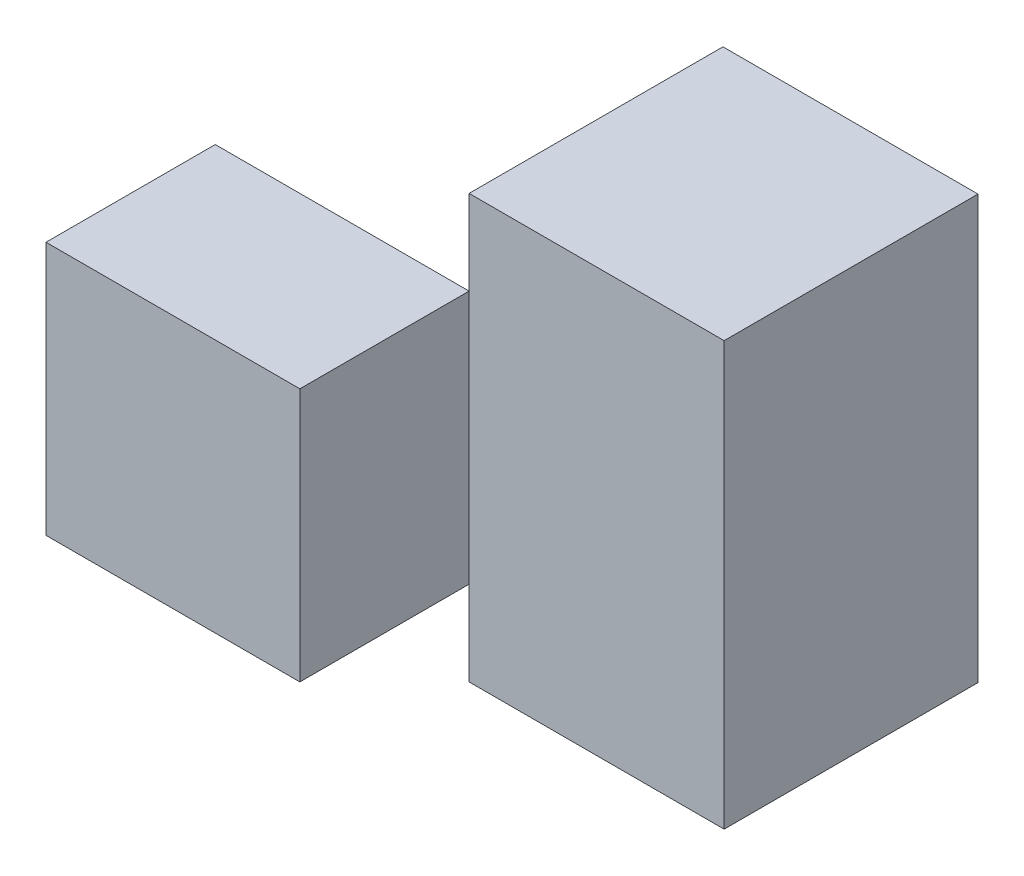
ISO-10303-21;
HEADER;
FILE_DESCRIPTION(('STEP AP214'),'2;1');
FILE_NAME('part.step','',(''),(''),'','','');
FILE_SCHEMA(('AUTOMOTIVE_DESIGN { 1 0 10303 214 1 1 1 1 }'));
ENDSEC;
DATA;
#1=APPLICATION_CONTEXT('core data for automotive mechanical design processes');
#2=APPLICATION_PROTOCOL_DEFINITION('international standard','automotive_design',2000,#1);
#3=PRODUCT_CONTEXT('',#1,'mechanical');
#4=PRODUCT('Part','Part','',(#3));
#5=PRODUCT_RELATED_PRODUCT_CATEGORY('part','',(#4));
#6=PRODUCT_DEFINITION_FORMATION('','',#4);
#7=PRODUCT_DEFINITION_CONTEXT('part definition',#1,'design');
#8=PRODUCT_DEFINITION('design','',#6,#7);
#9=PRODUCT_DEFINITION_SHAPE('','',#8);
#10=(LENGTH_UNIT() NAMED_UNIT(*) SI_UNIT(.MILLI.,.METRE.));
#11=(NAMED_UNIT(*) PLANE_ANGLE_UNIT() SI_UNIT($,.RADIAN.));
#12=(NAMED_UNIT(*) SI_UNIT($,.STERADIAN.) SOLID_ANGLE_UNIT());
#13=UNCERTAINTY_MEASURE_WITH_UNIT(LENGTH_MEASURE(1.E-05),#10,'distance_accuracy_value','');
#14=(GEOMETRIC_REPRESENTATION_CONTEXT(3) GLOBAL_UNCERTAINTY_ASSIGNED_CONTEXT((#13)) GLOBAL_UNIT_ASSIGNED_CONTEXT((#10,
#11,#12)) REPRESENTATION_CONTEXT('',''));
#15=CARTESIAN_POINT('',(0.,0.,0.));
#16=DIRECTION('',(0.,0.,1.));
#17=DIRECTION('',(1.,0.,0.));
#18=AXIS2_PLACEMENT_3D('',#15,#16,#17);
#19=CARTESIAN_POINT('',(-30.,-25.,50.));
#20=DIRECTION('',(1.,0.,0.));
#21=DIRECTION('',(0.,0.,-1.));
#22=AXIS2_PLACEMENT_3D('',#19,#20,#21);
#23=PLANE('',#22);
#24=DIRECTION('',(0.,0.,1.));
#25=VECTOR('',#24,1.);
#26=CARTESIAN_POINT('',(-30.,15.,0.));
#27=LINE('',#26,#25);
#28=CARTESIAN_POINT('',(-30.,15.,30.));
#29=VERTEX_POINT('',#28);
#30=CARTESIAN_POINT('',(-30.,15.,50.));
#31=VERTEX_POINT('',#30);
#32=EDGE_CURVE('E90',#29,#31,#27,.T.);
#33=ORIENTED_EDGE('',*,*,#32,.F.);
#34=DIRECTION('',(0.,1.,0.));
#35=VECTOR('',#34,1.);
#36=CARTESIAN_POINT('',(-30.,-35.,30.));
#37=LINE('',#36,#35);
#38=CARTESIAN_POINT('',(-30.,-15.,30.));
#39=VERTEX_POINT('',#38);
#40=EDGE_CURVE('E77',#39,#29,#37,.T.);
#41=ORIENTED_EDGE('',*,*,#40,.F.);
#42=DIRECTION('',(0.,0.,1.));
#43=VECTOR('',#42,1.);
#44=CARTESIAN_POINT('',(-30.,-15.,0.));
#45=LINE('',#44,#43);
#46=CARTESIAN_POINT('',(-30.,-15.,50.));
#47=VERTEX_POINT('',#46);
#48=EDGE_CURVE('E102',#39,#47,#45,.T.);
#49=ORIENTED_EDGE('',*,*,#48,.T.);
#50=DIRECTION('',(0.,-1.,0.));
#51=VECTOR('',#50,1.);
#52=CARTESIAN_POINT('',(-30.,-25.,50.));
#53=LINE('',#52,#51);
#54=EDGE_CURVE('E101',#31,#47,#53,.T.);
#55=ORIENTED_EDGE('',*,*,#54,.F.);
#56=EDGE_LOOP('',(#33,#41,#49,#55));
#57=FACE_BOUND('',#56,.T.);
#58=ADVANCED_FACE('F44',(#57),#23,.F.);
#59=CARTESIAN_POINT('',(0.,0.,50.));
#60=DIRECTION('',(0.,0.,-1.));
#61=DIRECTION('',(-1.,0.,0.));
#62=AXIS2_PLACEMENT_3D('',#59,#60,#61);
#63=PLANE('',#62);
#64=DIRECTION('',(-1.,0.,0.));
#65=VECTOR('',#64,1.);
#66=CARTESIAN_POINT('',(-30.,-15.,50.));
#67=LINE('',#66,#65);
#68=CARTESIAN_POINT('',(0.,-15.,50.));
#69=VERTEX_POINT('',#68);
#70=EDGE_CURVE('E84',#69,#47,#67,.T.);
#71=ORIENTED_EDGE('',*,*,#70,.F.);
#72=DIRECTION('',(0.,1.,0.));
#73=VECTOR('',#72,1.);
#74=CARTESIAN_POINT('',(0.,-35.,50.));
#75=LINE('',#74,#73);
#76=CARTESIAN_POINT('',(0.,15.,50.));
#77=VERTEX_POINT('',#76);
#78=EDGE_CURVE('E95',#69,#77,#75,.T.);
#79=ORIENTED_EDGE('',*,*,#78,.T.);
#80=DIRECTION('',(1.,0.,0.));
#81=VECTOR('',#80,1.);
#82=CARTESIAN_POINT('',(-30.,15.,50.));
#83=LINE('',#82,#81);
#84=EDGE_CURVE('E99',#31,#77,#83,.T.);
#85=ORIENTED_EDGE('',*,*,#84,.F.);
#86=ORIENTED_EDGE('',*,*,#54,.T.);
#87=EDGE_LOOP('',(#71,#79,#85,#86));
#88=FACE_BOUND('',#87,.T.);
#89=ADVANCED_FACE('F97',(#88),#63,.F.);
#90=CARTESIAN_POINT('',(-30.,15.,0.));
#91=DIRECTION('',(0.,-1.,0.));
#92=DIRECTION('',(0.,0.,-1.));
#93=AXIS2_PLACEMENT_3D('',#90,#91,#92);
#94=PLANE('',#93);
#95=ORIENTED_EDGE('',*,*,#84,.T.);
#96=DIRECTION('',(0.,0.,1.));
#97=VECTOR('',#96,1.);
#98=CARTESIAN_POINT('',(0.,15.,0.));
#99=LINE('',#98,#97);
#100=CARTESIAN_POINT('',(0.,15.,30.));
#101=VERTEX_POINT('',#100);
#102=EDGE_CURVE('E13',#101,#77,#99,.T.);
#103=ORIENTED_EDGE('',*,*,#102,.F.);
#104=DIRECTION('',(1.,0.,0.));
#105=VECTOR('',#104,1.);
#106=CARTESIAN_POINT('',(0.,15.,30.));
#107=LINE('',#106,#105);
#108=EDGE_CURVE('E114',#29,#101,#107,.T.);
#109=ORIENTED_EDGE('',*,*,#108,.F.);
#110=ORIENTED_EDGE('',*,*,#32,.T.);
#111=EDGE_LOOP('',(#95,#103,#109,#110));
#112=FACE_BOUND('',#111,.T.);
#113=ADVANCED_FACE('F103',(#112),#94,.F.);
#114=CARTESIAN_POINT('',(-30.,-15.,0.));
#115=DIRECTION('',(0.,1.,0.));
#116=DIRECTION('',(0.,0.,1.));
#117=AXIS2_PLACEMENT_3D('',#114,#115,#116);
#118=PLANE('',#117);
#119=DIRECTION('',(1.,0.,0.));
#120=VECTOR('',#119,1.);
#121=CARTESIAN_POINT('',(-30.,-15.,30.));
#122=LINE('',#121,#120);
#123=CARTESIAN_POINT('',(0.,-15.,30.));
#124=VERTEX_POINT('',#123);
#125=EDGE_CURVE('E105',#39,#124,#122,.T.);
#126=ORIENTED_EDGE('',*,*,#125,.T.);
#127=DIRECTION('',(0.,0.,1.));
#128=VECTOR('',#127,1.);
#129=CARTESIAN_POINT('',(0.,-15.,0.));
#130=LINE('',#129,#128);
#131=EDGE_CURVE('E62',#124,#69,#130,.T.);
#132=ORIENTED_EDGE('',*,*,#131,.T.);
#133=ORIENTED_EDGE('',*,*,#70,.T.);
#134=ORIENTED_EDGE('',*,*,#48,.F.);
#135=EDGE_LOOP('',(#126,#132,#133,#134));
#136=FACE_BOUND('',#135,.T.);
#137=ADVANCED_FACE('F116',(#136),#118,.F.);
#138=CARTESIAN_POINT('',(0.,-35.,30.));
#139=DIRECTION('',(0.,0.,1.));
#140=DIRECTION('',(1.,0.,0.));
#141=AXIS2_PLACEMENT_3D('',#138,#139,#140);
#142=PLANE('',#141);
#143=ORIENTED_EDGE('',*,*,#40,.T.);
#144=ORIENTED_EDGE('',*,*,#108,.T.);
#145=DIRECTION('',(0.,1.,0.));
#146=VECTOR('',#145,1.);
#147=CARTESIAN_POINT('',(0.,-35.,30.));
#148=LINE('',#147,#146);
#149=EDGE_CURVE('E48',#124,#101,#148,.T.);
#150=ORIENTED_EDGE('',*,*,#149,.F.);
#151=ORIENTED_EDGE('',*,*,#125,.F.);
#152=EDGE_LOOP('',(#143,#144,#150,#151));
#153=FACE_BOUND('',#152,.T.);
#154=ADVANCED_FACE('F117',(#153),#142,.F.);
#155=CARTESIAN_POINT('',(0.,-35.,0.));
#156=DIRECTION('',(-1.,0.,0.));
#157=DIRECTION('',(0.,0.,1.));
#158=AXIS2_PLACEMENT_3D('',#155,#156,#157);
#159=PLANE('',#158);
#160=ORIENTED_EDGE('',*,*,#149,.T.);
#161=ORIENTED_EDGE('',*,*,#102,.T.);
#162=ORIENTED_EDGE('',*,*,#78,.F.);
#163=ORIENTED_EDGE('',*,*,#131,.F.);
#164=EDGE_LOOP('',(#160,#161,#162,#163));
#165=FACE_BOUND('',#164,.T.);
#166=ADVANCED_FACE('F46',(#165),#159,.F.);
#167=CLOSED_SHELL('',(#58,#89,#113,#137,#154,#166));
#168=MANIFOLD_SOLID_BREP('B2',#167);
#169=CARTESIAN_POINT('',(0.,25.,0.));
#170=DIRECTION('',(1.,0.,0.));
#171=DIRECTION('',(0.,0.,-1.));
#172=AXIS2_PLACEMENT_3D('',#169,#170,#171);
#173=PLANE('',#172);
#174=DIRECTION('',(0.,0.,1.));
#175=VECTOR('',#174,1.);
#176=CARTESIAN_POINT('',(0.,15.,9.999));
#177=LINE('',#176,#175);
#178=CARTESIAN_POINT('',(0.,15.,0.));
#179=VERTEX_POINT('',#178);
#180=CARTESIAN_POINT('',(0.,15.,29.9981));
#181=VERTEX_POINT('',#180);
#182=EDGE_CURVE('E285',#179,#181,#177,.T.);
#183=ORIENTED_EDGE('',*,*,#182,.T.);
#184=DIRECTION('',(0.,-1.,0.));
#185=VECTOR('',#184,1.);
#186=CARTESIAN_POINT('',(0.,15.,29.9981));
#187=LINE('',#186,#185);
#188=CARTESIAN_POINT('',(0.,-15.,29.9981));
#189=VERTEX_POINT('',#188);
#190=EDGE_CURVE('E281',#181,#189,#187,.T.);
#191=ORIENTED_EDGE('',*,*,#190,.T.);
#192=DIRECTION('',(0.,0.,1.));
#193=VECTOR('',#192,1.);
#194=CARTESIAN_POINT('',(0.,-15.,9.999));
#195=LINE('',#194,#193);
#196=CARTESIAN_POINT('',(0.,-15.,0.));
#197=VERTEX_POINT('',#196);
#198=EDGE_CURVE('E284',#197,#189,#195,.T.);
#199=ORIENTED_EDGE('',*,*,#198,.F.);
#200=DIRECTION('',(0.,1.,0.));
#201=VECTOR('',#200,1.);
#202=CARTESIAN_POINT('',(0.,25.,0.));
#203=LINE('',#202,#201);
#204=CARTESIAN_POINT('',(0.,-25.,0.));
#205=VERTEX_POINT('',#204);
#206=EDGE_CURVE('E300',#205,#197,#203,.T.);
#207=ORIENTED_EDGE('',*,*,#206,.F.);
#208=DIRECTION('',(0.,0.,1.));
#209=VECTOR('',#208,1.);
#210=CARTESIAN_POINT('',(0.,-25.,0.));
#211=LINE('',#210,#209);
#212=CARTESIAN_POINT('',(0.,-25.,30.));
#213=VERTEX_POINT('',#212);
#214=EDGE_CURVE('E298',#205,#213,#211,.T.);
#215=ORIENTED_EDGE('',*,*,#214,.T.);
#216=DIRECTION('',(0.,-1.,0.));
#217=VECTOR('',#216,1.);
#218=CARTESIAN_POINT('',(0.,25.,30.));
#219=LINE('',#218,#217);
#220=CARTESIAN_POINT('',(0.,25.,30.));
#221=VERTEX_POINT('',#220);
#222=EDGE_CURVE('E245',#221,#213,#219,.T.);
#223=ORIENTED_EDGE('',*,*,#222,.F.);
#224=DIRECTION('',(0.,0.,1.));
#225=VECTOR('',#224,1.);
#226=CARTESIAN_POINT('',(0.,25.,0.));
#227=LINE('',#226,#225);
#228=CARTESIAN_POINT('',(0.,25.,0.));
#229=VERTEX_POINT('',#228);
#230=EDGE_CURVE('E303',#229,#221,#227,.T.);
#231=ORIENTED_EDGE('',*,*,#230,.F.);
#232=EDGE_CURVE('E196',#179,#229,#203,.T.);
#233=ORIENTED_EDGE('',*,*,#232,.F.);
#234=EDGE_LOOP('',(#183,#191,#199,#207,#215,#223,#231,#233));
#235=FACE_BOUND('',#234,.T.);
#236=ADVANCED_FACE('F174',(#235),#173,.F.);
#237=CARTESIAN_POINT('',(-30.,25.,50.));
#238=DIRECTION('',(0.,-1.,0.));
#239=DIRECTION('',(0.,0.,-1.));
#240=AXIS2_PLACEMENT_3D('',#237,#238,#239);
#241=PLANE('',#240);
#242=ORIENTED_EDGE('',*,*,#230,.T.);
#243=DIRECTION('',(-1.,0.,0.));
#244=VECTOR('',#243,1.);
#245=CARTESIAN_POINT('',(50.,25.,30.));
#246=LINE('',#245,#244);
#247=CARTESIAN_POINT('',(30.14,25.,30.));
#248=VERTEX_POINT('',#247);
#249=EDGE_CURVE('E296',#248,#221,#246,.T.);
#250=ORIENTED_EDGE('',*,*,#249,.F.);
#251=DIRECTION('',(0.,0.,1.));
#252=VECTOR('',#251,1.);
#253=CARTESIAN_POINT('',(30.14,25.,30.));
#254=LINE('',#253,#252);
#255=CARTESIAN_POINT('',(30.14,25.,0.));
#256=VERTEX_POINT('',#255);
#257=EDGE_CURVE('E263',#256,#248,#254,.T.);
#258=ORIENTED_EDGE('',*,*,#257,.F.);
#259=DIRECTION('',(-1.,0.,0.));
#260=VECTOR('',#259,1.);
#261=CARTESIAN_POINT('',(-30.,25.,0.));
#262=LINE('',#261,#260);
#263=EDGE_CURVE('E182',#256,#229,#262,.T.);
#264=ORIENTED_EDGE('',*,*,#263,.T.);
#265=EDGE_LOOP('',(#242,#250,#258,#264));
#266=FACE_BOUND('',#265,.T.);
#267=ADVANCED_FACE('F176',(#266),#241,.F.);
#268=CARTESIAN_POINT('',(-30.,-25.,50.));
#269=DIRECTION('',(0.,1.,0.));
#270=DIRECTION('',(0.,0.,1.));
#271=AXIS2_PLACEMENT_3D('',#268,#269,#270);
#272=PLANE('',#271);
#273=DIRECTION('',(1.,0.,0.));
#274=VECTOR('',#273,1.);
#275=CARTESIAN_POINT('',(-30.,-25.,0.));
#276=LINE('',#275,#274);
#277=CARTESIAN_POINT('',(30.14,-25.,0.));
#278=VERTEX_POINT('',#277);
#279=EDGE_CURVE('E42',#205,#278,#276,.T.);
#280=ORIENTED_EDGE('',*,*,#279,.T.);
#281=DIRECTION('',(0.,0.,-1.));
#282=VECTOR('',#281,1.);
#283=CARTESIAN_POINT('',(30.14,-25.,30.));
#284=LINE('',#283,#282);
#285=CARTESIAN_POINT('',(30.14,-25.,30.));
#286=VERTEX_POINT('',#285);
#287=EDGE_CURVE('E252',#286,#278,#284,.T.);
#288=ORIENTED_EDGE('',*,*,#287,.F.);
#289=DIRECTION('',(-1.,0.,0.));
#290=VECTOR('',#289,1.);
#291=CARTESIAN_POINT('',(50.,-25.,30.));
#292=LINE('',#291,#290);
#293=EDGE_CURVE('E239',#286,#213,#292,.T.);
#294=ORIENTED_EDGE('',*,*,#293,.T.);
#295=ORIENTED_EDGE('',*,*,#214,.F.);
#296=EDGE_LOOP('',(#280,#288,#294,#295));
#297=FACE_BOUND('',#296,.T.);
#298=ADVANCED_FACE('F253',(#297),#272,.F.);
#299=CARTESIAN_POINT('',(0.,0.,0.));
#300=DIRECTION('',(0.,0.,-1.));
#301=DIRECTION('',(-1.,0.,0.));
#302=AXIS2_PLACEMENT_3D('',#299,#300,#301);
#303=PLANE('',#302);
#304=ORIENTED_EDGE('',*,*,#279,.F.);
#305=ORIENTED_EDGE('',*,*,#206,.T.);
#306=DIRECTION('',(0.,-1.,0.));
#307=VECTOR('',#306,1.);
#308=CARTESIAN_POINT('',(0.,15.,0.));
#309=LINE('',#308,#307);
#310=EDGE_CURVE('E189',#179,#197,#309,.T.);
#311=ORIENTED_EDGE('',*,*,#310,.F.);
#312=ORIENTED_EDGE('',*,*,#232,.T.);
#313=ORIENTED_EDGE('',*,*,#263,.F.);
#314=DIRECTION('',(0.,1.,0.));
#315=VECTOR('',#314,1.);
#316=CARTESIAN_POINT('',(30.14,25.,0.));
#317=LINE('',#316,#315);
#318=EDGE_CURVE('E258',#278,#256,#317,.T.);
#319=ORIENTED_EDGE('',*,*,#318,.F.);
#320=EDGE_LOOP('',(#304,#305,#311,#312,#313,#319));
#321=FACE_BOUND('',#320,.T.);
#322=ADVANCED_FACE('F307',(#321),#303,.T.);
#323=CARTESIAN_POINT('',(50.,25.,30.));
#324=DIRECTION('',(0.,0.,-1.));
#325=DIRECTION('',(-1.,0.,0.));
#326=AXIS2_PLACEMENT_3D('',#323,#324,#325);
#327=PLANE('',#326);
#328=ORIENTED_EDGE('',*,*,#249,.T.);
#329=ORIENTED_EDGE('',*,*,#222,.T.);
#330=ORIENTED_EDGE('',*,*,#293,.F.);
#331=DIRECTION('',(0.,-1.,0.));
#332=VECTOR('',#331,1.);
#333=CARTESIAN_POINT('',(30.14,25.,30.));
#334=LINE('',#333,#332);
#335=EDGE_CURVE('E243',#248,#286,#334,.T.);
#336=ORIENTED_EDGE('',*,*,#335,.F.);
#337=EDGE_LOOP('',(#328,#329,#330,#336));
#338=FACE_BOUND('',#337,.T.);
#339=ADVANCED_FACE('F241',(#338),#327,.F.);
#340=CARTESIAN_POINT('',(0.,15.,0.));
#341=DIRECTION('',(-0.316208791528653,0.,0.948689622669073));
#342=DIRECTION('',(0.948689622669074,0.,0.316208791528653));
#343=AXIS2_PLACEMENT_3D('',#340,#341,#342);
#344=PLANE('',#343);
#345=DIRECTION('',(-0.948689622669073,0.,-0.316208791528653));
#346=VECTOR('',#345,1.);
#347=CARTESIAN_POINT('',(0.,-15.,0.));
#348=LINE('',#347,#346);
#349=CARTESIAN_POINT('',(29.999,-15.,9.999));
#350=VERTEX_POINT('',#349);
#351=EDGE_CURVE('E288',#350,#197,#348,.T.);
#352=ORIENTED_EDGE('',*,*,#351,.F.);
#353=DIRECTION('',(0.,-1.,0.));
#354=VECTOR('',#353,1.);
#355=CARTESIAN_POINT('',(29.999,15.,9.999));
#356=LINE('',#355,#354);
#357=CARTESIAN_POINT('',(29.999,15.,9.999));
#358=VERTEX_POINT('',#357);
#359=EDGE_CURVE('E249',#358,#350,#356,.T.);
#360=ORIENTED_EDGE('',*,*,#359,.F.);
#361=DIRECTION('',(-0.948689622669073,0.,-0.316208791528653));
#362=VECTOR('',#361,1.);
#363=CARTESIAN_POINT('',(0.,15.,0.));
#364=LINE('',#363,#362);
#365=EDGE_CURVE('E287',#358,#179,#364,.T.);
#366=ORIENTED_EDGE('',*,*,#365,.T.);
#367=ORIENTED_EDGE('',*,*,#310,.T.);
#368=EDGE_LOOP('',(#352,#360,#366,#367));
#369=FACE_BOUND('',#368,.T.);
#370=ADVANCED_FACE('F322',(#369),#344,.T.);
#371=CARTESIAN_POINT('',(0.,15.,0.));
#372=DIRECTION('',(0.,1.,0.));
#373=DIRECTION('',(0.,0.,1.));
#374=AXIS2_PLACEMENT_3D('',#371,#372,#373);
#375=PLANE('',#374);
#376=ORIENTED_EDGE('',*,*,#182,.F.);
#377=ORIENTED_EDGE('',*,*,#365,.F.);
#378=DIRECTION('',(0.,0.,-1.));
#379=VECTOR('',#378,1.);
#380=CARTESIAN_POINT('',(29.999,15.,9.9991));
#381=LINE('',#380,#379);
#382=CARTESIAN_POINT('',(29.999,15.,9.9991));
#383=VERTEX_POINT('',#382);
#384=EDGE_CURVE('E269',#383,#358,#381,.T.);
#385=ORIENTED_EDGE('',*,*,#384,.F.);
#386=DIRECTION('',(0.83205456140193,0.,-0.554693795575759));
#387=VECTOR('',#386,1.);
#388=CARTESIAN_POINT('',(29.999,15.,9.9991));
#389=LINE('',#388,#387);
#390=EDGE_CURVE('E273',#181,#383,#389,.T.);
#391=ORIENTED_EDGE('',*,*,#390,.F.);
#392=EDGE_LOOP('',(#376,#377,#385,#391));
#393=FACE_BOUND('',#392,.T.);
#394=ADVANCED_FACE('F324',(#393),#375,.F.);
#395=CARTESIAN_POINT('',(0.,-15.,0.));
#396=DIRECTION('',(0.,1.,0.));
#397=DIRECTION('',(0.,0.,1.));
#398=AXIS2_PLACEMENT_3D('',#395,#396,#397);
#399=PLANE('',#398);
#400=ORIENTED_EDGE('',*,*,#198,.T.);
#401=DIRECTION('',(0.83205456140193,0.,-0.554693795575759));
#402=VECTOR('',#401,1.);
#403=CARTESIAN_POINT('',(29.999,-15.,9.9991));
#404=LINE('',#403,#402);
#405=CARTESIAN_POINT('',(29.999,-15.,9.9991));
#406=VERTEX_POINT('',#405);
#407=EDGE_CURVE('E271',#189,#406,#404,.T.);
#408=ORIENTED_EDGE('',*,*,#407,.T.);
#409=DIRECTION('',(0.,0.,-1.));
#410=VECTOR('',#409,1.);
#411=CARTESIAN_POINT('',(29.999,-15.,9.9991));
#412=LINE('',#411,#410);
#413=EDGE_CURVE('E268',#406,#350,#412,.T.);
#414=ORIENTED_EDGE('',*,*,#413,.T.);
#415=ORIENTED_EDGE('',*,*,#351,.T.);
#416=EDGE_LOOP('',(#400,#408,#414,#415));
#417=FACE_BOUND('',#416,.T.);
#418=ADVANCED_FACE('F313',(#417),#399,.T.);
#419=CARTESIAN_POINT('',(29.999,15.,9.9991));
#420=DIRECTION('',(-0.554693795575759,0.,-0.83205456140193));
#421=DIRECTION('',(-0.83205456140193,0.,0.554693795575759));
#422=AXIS2_PLACEMENT_3D('',#419,#420,#421);
#423=PLANE('',#422);
#424=ORIENTED_EDGE('',*,*,#407,.F.);
#425=ORIENTED_EDGE('',*,*,#190,.F.);
#426=ORIENTED_EDGE('',*,*,#390,.T.);
#427=DIRECTION('',(0.,-1.,0.));
#428=VECTOR('',#427,1.);
#429=CARTESIAN_POINT('',(29.999,15.,9.9991));
#430=LINE('',#429,#428);
#431=EDGE_CURVE('E276',#383,#406,#430,.T.);
#432=ORIENTED_EDGE('',*,*,#431,.T.);
#433=EDGE_LOOP('',(#424,#425,#426,#432));
#434=FACE_BOUND('',#433,.T.);
#435=ADVANCED_FACE('F315',(#434),#423,.T.);
#436=CARTESIAN_POINT('',(29.999,0.,9.9991));
#437=DIRECTION('',(1.,0.,0.));
#438=DIRECTION('',(0.,0.,-1.));
#439=AXIS2_PLACEMENT_3D('',#436,#437,#438);
#440=PLANE('',#439);
#441=ORIENTED_EDGE('',*,*,#359,.T.);
#442=ORIENTED_EDGE('',*,*,#413,.F.);
#443=ORIENTED_EDGE('',*,*,#431,.F.);
#444=ORIENTED_EDGE('',*,*,#384,.T.);
#445=EDGE_LOOP('',(#441,#442,#443,#444));
#446=FACE_BOUND('',#445,.T.);
#447=ADVANCED_FACE('F319',(#446),#440,.F.);
#448=CARTESIAN_POINT('',(30.14,0.,0.));
#449=DIRECTION('',(1.,0.,0.));
#450=DIRECTION('',(0.,0.,-1.));
#451=AXIS2_PLACEMENT_3D('',#448,#449,#450);
#452=PLANE('',#451);
#453=ORIENTED_EDGE('',*,*,#335,.T.);
#454=ORIENTED_EDGE('',*,*,#287,.T.);
#455=ORIENTED_EDGE('',*,*,#318,.T.);
#456=ORIENTED_EDGE('',*,*,#257,.T.);
#457=EDGE_LOOP('',(#453,#454,#455,#456));
#458=FACE_BOUND('',#457,.T.);
#459=ADVANCED_FACE('F261',(#458),#452,.T.);
#460=CLOSED_SHELL('',(#236,#267,#298,#322,#339,#370,#394,#418,#435,#447,#459));
#461=MANIFOLD_SOLID_BREP('B7',#460);
#462=ADVANCED_BREP_SHAPE_REPRESENTATION('',(#18,#168,#461),#14);
#463=SHAPE_DEFINITION_REPRESENTATION(#9,#462);
ENDSEC;
END-ISO-10303-21;
